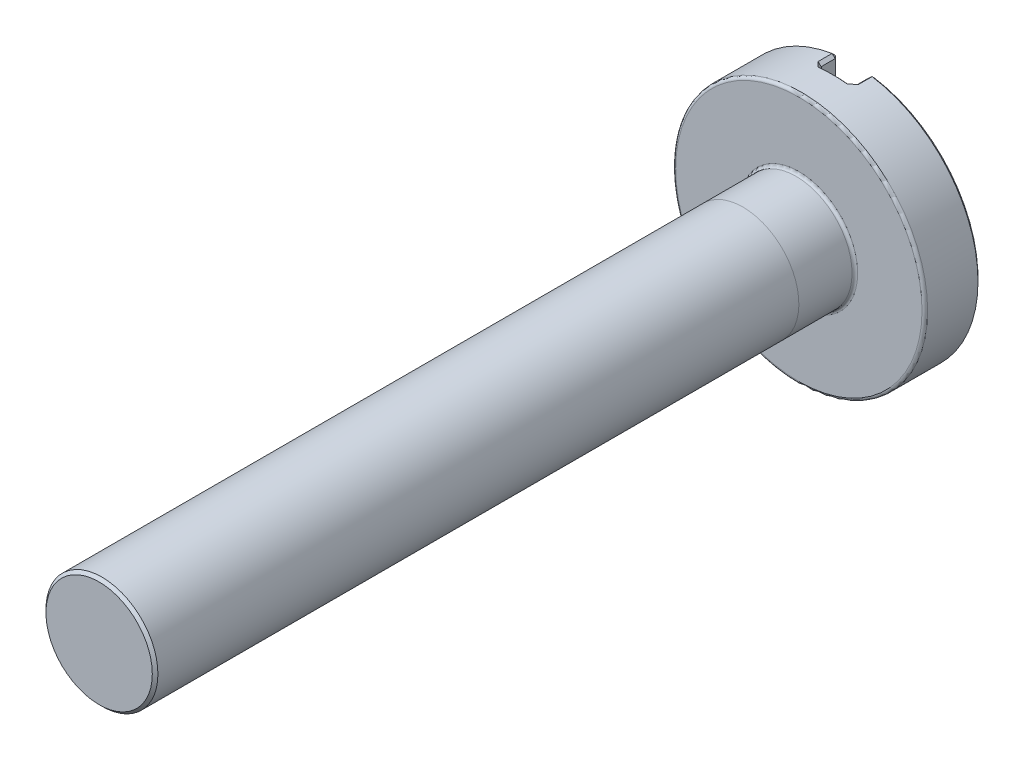
ISO-10303-21;
HEADER;
FILE_DESCRIPTION(('STEP AP214'),'2;1');
FILE_NAME('part.step','',(''),(''),'','','');
FILE_SCHEMA(('AUTOMOTIVE_DESIGN { 1 0 10303 214 1 1 1 1 }'));
ENDSEC;
DATA;
#1=APPLICATION_CONTEXT('core data for automotive mechanical design processes');
#2=APPLICATION_PROTOCOL_DEFINITION('international standard','automotive_design',2000,#1);
#3=PRODUCT_CONTEXT('',#1,'mechanical');
#4=PRODUCT('Part','Part','',(#3));
#5=PRODUCT_RELATED_PRODUCT_CATEGORY('part','',(#4));
#6=PRODUCT_DEFINITION_FORMATION('','',#4);
#7=PRODUCT_DEFINITION_CONTEXT('part definition',#1,'design');
#8=PRODUCT_DEFINITION('design','',#6,#7);
#9=PRODUCT_DEFINITION_SHAPE('','',#8);
#10=(LENGTH_UNIT() NAMED_UNIT(*) SI_UNIT(.MILLI.,.METRE.));
#11=(NAMED_UNIT(*) PLANE_ANGLE_UNIT() SI_UNIT($,.RADIAN.));
#12=(NAMED_UNIT(*) SI_UNIT($,.STERADIAN.) SOLID_ANGLE_UNIT());
#13=UNCERTAINTY_MEASURE_WITH_UNIT(LENGTH_MEASURE(1.E-05),#10,'distance_accuracy_value','');
#14=(GEOMETRIC_REPRESENTATION_CONTEXT(3) GLOBAL_UNCERTAINTY_ASSIGNED_CONTEXT((#13)) GLOBAL_UNIT_ASSIGNED_CONTEXT((#10,
#11,#12)) REPRESENTATION_CONTEXT('',''));
#15=CARTESIAN_POINT('',(0.,0.,0.));
#16=DIRECTION('',(0.,0.,1.));
#17=DIRECTION('',(1.,0.,0.));
#18=AXIS2_PLACEMENT_3D('',#15,#16,#17);
#19=CARTESIAN_POINT('',(0.,0.,12.5));
#20=DIRECTION('',(0.,0.,-1.));
#21=DIRECTION('',(-1.,0.,0.));
#22=AXIS2_PLACEMENT_3D('',#19,#20,#21);
#23=CYLINDRICAL_SURFACE('',#22,1.);
#24=CARTESIAN_POINT('',(0.,0.,12.45));
#25=DIRECTION('',(0.,0.,1.));
#26=DIRECTION('',(1.,0.,0.));
#27=AXIS2_PLACEMENT_3D('',#24,#25,#26);
#28=CIRCLE('',#27,1.);
#29=CARTESIAN_POINT('',(1.,0.,12.45));
#30=VERTEX_POINT('',#29);
#31=EDGE_CURVE('E49',#30,#30,#28,.F.);
#32=ORIENTED_EDGE('',*,*,#31,.T.);
#33=EDGE_LOOP('',(#32));
#34=FACE_BOUND('',#33,.T.);
#35=CARTESIAN_POINT('',(0.,0.,1.));
#36=DIRECTION('',(0.,0.,-1.));
#37=DIRECTION('',(0.,1.,0.));
#38=AXIS2_PLACEMENT_3D('',#35,#36,#37);
#39=CIRCLE('',#38,1.);
#40=CARTESIAN_POINT('',(0.,1.,1.));
#41=VERTEX_POINT('',#40);
#42=EDGE_CURVE('E11',#41,#41,#39,.T.);
#43=ORIENTED_EDGE('',*,*,#42,.F.);
#44=EDGE_LOOP('',(#43));
#45=FACE_BOUND('',#44,.T.);
#46=ADVANCED_FACE('F39',(#34,#45),#23,.T.);
#47=CARTESIAN_POINT('',(0.,0.,-1.));
#48=DIRECTION('',(0.,0.,1.));
#49=DIRECTION('',(1.,0.,0.));
#50=AXIS2_PLACEMENT_3D('',#47,#48,#49);
#51=CYLINDRICAL_SURFACE('',#50,2.25);
#52=CARTESIAN_POINT('',(0.,0.,-0.05));
#53=DIRECTION('',(0.,0.,1.));
#54=DIRECTION('',(1.,0.,0.));
#55=AXIS2_PLACEMENT_3D('',#52,#53,#54);
#56=CIRCLE('',#55,2.25);
#57=CARTESIAN_POINT('',(2.25,0.,-0.05));
#58=VERTEX_POINT('',#57);
#59=EDGE_CURVE('E506',#58,#58,#56,.F.);
#60=ORIENTED_EDGE('',*,*,#59,.T.);
#61=EDGE_LOOP('',(#60));
#62=FACE_BOUND('',#61,.T.);
#63=CARTESIAN_POINT('',(0.357954545454545,-2.22134385978138,-0.7));
#64=CARTESIAN_POINT('',(0.349044313577281,-2.22277959220945,-0.691081725524456));
#65=CARTESIAN_POINT('',(0.340106008970925,-2.22416500607063,-0.682183310951015));
#66=CARTESIAN_POINT('',(0.322168315908917,-2.22683406364462,-0.66443290328283));
#67=CARTESIAN_POINT('',(0.313168927393422,-2.2281177072577,-0.655580910233578));
#68=CARTESIAN_POINT('',(0.288093679970526,-2.2315384498966,-0.631080236997653));
#69=CARTESIAN_POINT('',(0.271946710820839,-2.23356468320811,-0.615488807873462));
#70=CARTESIAN_POINT('',(0.255681818186013,-2.23542541988267,-0.600000000002841));
#71=B_SPLINE_CURVE_WITH_KNOTS('',3,(#63,#64,#65,#66,#67,#68,#69,#70),.UNSPECIFIED.,.F.,.F.,(4,2,
2,4),(0.,0.0380643972705644,0.0761288318363076,0.143736873551843),.UNSPECIFIED.);
#72=CARTESIAN_POINT('',(0.357954545454545,-2.22134385978138,-0.7));
#73=VERTEX_POINT('',#72);
#74=CARTESIAN_POINT('',(0.255681818181818,-2.23542541988124,-0.6));
#75=VERTEX_POINT('',#74);
#76=EDGE_CURVE('E251',#73,#75,#71,.T.);
#77=ORIENTED_EDGE('',*,*,#76,.F.);
#78=DIRECTION('',(0.,0.,1.));
#79=VECTOR('',#78,1.);
#80=CARTESIAN_POINT('',(0.357954545454545,-2.22134385978138,-1.));
#81=LINE('',#80,#79);
#82=CARTESIAN_POINT('',(0.357954545454545,-2.22134385978138,-0.95));
#83=VERTEX_POINT('',#82);
#84=EDGE_CURVE('E249',#73,#83,#81,.F.);
#85=ORIENTED_EDGE('',*,*,#84,.T.);
#86=CARTESIAN_POINT('',(0.,0.,-0.95));
#87=DIRECTION('',(0.,0.,1.));
#88=DIRECTION('',(1.,0.,0.));
#89=AXIS2_PLACEMENT_3D('',#86,#87,#88);
#90=CIRCLE('',#89,2.25);
#91=CARTESIAN_POINT('',(0.357954545454545,2.22134385978138,-0.95));
#92=VERTEX_POINT('',#91);
#93=EDGE_CURVE('E245',#83,#92,#90,.T.);
#94=ORIENTED_EDGE('',*,*,#93,.T.);
#95=DIRECTION('',(0.,0.,1.));
#96=VECTOR('',#95,1.);
#97=CARTESIAN_POINT('',(0.357954545454545,2.22134385978138,-1.));
#98=LINE('',#97,#96);
#99=CARTESIAN_POINT('',(0.357954545454545,2.22134385978138,-0.7));
#100=VERTEX_POINT('',#99);
#101=EDGE_CURVE('E236',#92,#100,#98,.T.);
#102=ORIENTED_EDGE('',*,*,#101,.T.);
#103=CARTESIAN_POINT('',(0.255681818181818,2.23542541988124,-0.6));
#104=CARTESIAN_POINT('',(0.264839427943543,2.23437790052862,-0.608719796943994));
#105=CARTESIAN_POINT('',(0.273959417330191,2.23327784719118,-0.617472569925155));
#106=CARTESIAN_POINT('',(0.29212937173172,2.23097387990717,-0.635036917762392));
#107=CARTESIAN_POINT('',(0.301179336862998,2.22976996613328,-0.643848492520682));
#108=CARTESIAN_POINT('',(0.326213414850236,2.22628523492306,-0.668382417252336));
#109=CARTESIAN_POINT('',(0.342127740146839,2.22389382114135,-0.68416044499739));
#110=CARTESIAN_POINT('',(0.357954545456661,2.22134385978236,-0.700000000001358));
#111=B_SPLINE_CURVE_WITH_KNOTS('',3,(#103,#104,#105,#106,#107,#108,#109,#110),.UNSPECIFIED.,.F.,
.F.,(4,2,2,4),(0.,0.0380645508803724,0.0761290384749272,0.143736997088426),.UNSPECIFIED.);
#112=CARTESIAN_POINT('',(0.255681818181818,2.23542541988124,-0.6));
#113=VERTEX_POINT('',#112);
#114=EDGE_CURVE('E229',#113,#100,#111,.T.);
#115=ORIENTED_EDGE('',*,*,#114,.F.);
#116=CARTESIAN_POINT('',(0.,0.,-0.6));
#117=DIRECTION('',(0.,0.,-1.));
#118=DIRECTION('',(-1.,0.,0.));
#119=AXIS2_PLACEMENT_3D('',#116,#117,#118);
#120=CIRCLE('',#119,2.25);
#121=CARTESIAN_POINT('',(-0.255681818181818,2.23542541988124,-0.6));
#122=VERTEX_POINT('',#121);
#123=EDGE_CURVE('E192',#113,#122,#120,.F.);
#124=ORIENTED_EDGE('',*,*,#123,.T.);
#125=CARTESIAN_POINT('',(-0.357954545454545,2.22134385978138,-0.7));
#126=CARTESIAN_POINT('',(-0.349044313577281,2.22277959220945,-0.691081725524456));
#127=CARTESIAN_POINT('',(-0.340106008970926,2.22416500607064,-0.682183310951015));
#128=CARTESIAN_POINT('',(-0.322168315908917,2.22683406364462,-0.66443290328283));
#129=CARTESIAN_POINT('',(-0.313168927393423,2.2281177072577,-0.655580910233578));
#130=CARTESIAN_POINT('',(-0.288093679970526,2.2315384498966,-0.631080236997653));
#131=CARTESIAN_POINT('',(-0.271946710820839,2.23356468320811,-0.615488807873462));
#132=CARTESIAN_POINT('',(-0.255681818186013,2.23542541988267,-0.600000000002841));
#133=B_SPLINE_CURVE_WITH_KNOTS('',3,(#125,#126,#127,#128,#129,#130,#131,#132),.UNSPECIFIED.,.F.,
.F.,(4,2,2,4),(0.,0.0380643972705644,0.0761288318363076,0.143736873551843),.UNSPECIFIED.);
#134=CARTESIAN_POINT('',(-0.357954545454545,2.22134385978138,-0.7));
#135=VERTEX_POINT('',#134);
#136=EDGE_CURVE('E183',#135,#122,#133,.T.);
#137=ORIENTED_EDGE('',*,*,#136,.F.);
#138=DIRECTION('',(0.,0.,1.));
#139=VECTOR('',#138,1.);
#140=CARTESIAN_POINT('',(-0.357954545454545,2.22134385978138,-1.));
#141=LINE('',#140,#139);
#142=CARTESIAN_POINT('',(-0.357954545454545,2.22134385978138,-0.95));
#143=VERTEX_POINT('',#142);
#144=EDGE_CURVE('E180',#135,#143,#141,.F.);
#145=ORIENTED_EDGE('',*,*,#144,.T.);
#146=CARTESIAN_POINT('',(0.,0.,-0.95));
#147=DIRECTION('',(0.,0.,1.));
#148=DIRECTION('',(1.,0.,0.));
#149=AXIS2_PLACEMENT_3D('',#146,#147,#148);
#150=CIRCLE('',#149,2.25);
#151=CARTESIAN_POINT('',(-0.357954545454545,-2.22134385978138,-0.95));
#152=VERTEX_POINT('',#151);
#153=EDGE_CURVE('E175',#143,#152,#150,.T.);
#154=ORIENTED_EDGE('',*,*,#153,.T.);
#155=DIRECTION('',(0.,0.,1.));
#156=VECTOR('',#155,1.);
#157=CARTESIAN_POINT('',(-0.357954545454545,-2.22134385978138,-1.));
#158=LINE('',#157,#156);
#159=CARTESIAN_POINT('',(-0.357954545454545,-2.22134385978138,-0.7));
#160=VERTEX_POINT('',#159);
#161=EDGE_CURVE('E150',#152,#160,#158,.T.);
#162=ORIENTED_EDGE('',*,*,#161,.T.);
#163=CARTESIAN_POINT('',(-0.255681818181818,-2.23542541988124,-0.6));
#164=CARTESIAN_POINT('',(-0.264839427943543,-2.23437790052862,-0.608719796943994));
#165=CARTESIAN_POINT('',(-0.273959417330191,-2.23327784719118,-0.617472569925155));
#166=CARTESIAN_POINT('',(-0.29212937173172,-2.23097387990717,-0.635036917762393));
#167=CARTESIAN_POINT('',(-0.301179336862998,-2.22976996613328,-0.643848492520682));
#168=CARTESIAN_POINT('',(-0.326213414850237,-2.22628523492307,-0.668382417252336));
#169=CARTESIAN_POINT('',(-0.342127740146839,-2.22389382114135,-0.684160444997389));
#170=CARTESIAN_POINT('',(-0.357954545456661,-2.22134385978236,-0.700000000001358));
#171=B_SPLINE_CURVE_WITH_KNOTS('',3,(#163,#164,#165,#166,#167,#168,#169,#170),.UNSPECIFIED.,.F.,
.F.,(4,2,2,4),(0.,0.0380645508803725,0.0761290384749272,0.143736997088426),.UNSPECIFIED.);
#172=CARTESIAN_POINT('',(-0.255681818181818,-2.23542541988124,-0.6));
#173=VERTEX_POINT('',#172);
#174=EDGE_CURVE('E238',#173,#160,#171,.T.);
#175=ORIENTED_EDGE('',*,*,#174,.F.);
#176=CARTESIAN_POINT('',(0.,0.,-0.6));
#177=DIRECTION('',(0.,0.,-1.));
#178=DIRECTION('',(-1.,0.,0.));
#179=AXIS2_PLACEMENT_3D('',#176,#177,#178);
#180=CIRCLE('',#179,2.25);
#181=EDGE_CURVE('E247',#173,#75,#180,.F.);
#182=ORIENTED_EDGE('',*,*,#181,.T.);
#183=EDGE_LOOP('',(#77,#85,#94,#102,#115,#124,#137,#145,#154,#162,#175,#182));
#184=FACE_BOUND('',#183,.T.);
#185=ADVANCED_FACE('F194',(#62,#184),#51,.T.);
#186=CARTESIAN_POINT('',(0.,0.,-1.));
#187=DIRECTION('',(0.,0.,1.));
#188=DIRECTION('',(1.,0.,0.));
#189=AXIS2_PLACEMENT_3D('',#186,#187,#188);
#190=PLANE('',#189);
#191=CARTESIAN_POINT('',(0.,0.,-1.));
#192=DIRECTION('',(0.,0.,1.));
#193=DIRECTION('',(1.,0.,0.));
#194=AXIS2_PLACEMENT_3D('',#191,#192,#193);
#195=CIRCLE('',#194,2.2);
#196=CARTESIAN_POINT('',(0.35,2.17198066289735,-1.));
#197=VERTEX_POINT('',#196);
#198=CARTESIAN_POINT('',(0.35,-2.17198066289735,-1.));
#199=VERTEX_POINT('',#198);
#200=EDGE_CURVE('E551',#197,#199,#195,.F.);
#201=ORIENTED_EDGE('',*,*,#200,.T.);
#202=DIRECTION('',(0.,1.,0.));
#203=VECTOR('',#202,1.);
#204=CARTESIAN_POINT('',(0.35,0.,-1.));
#205=LINE('',#204,#203);
#206=EDGE_CURVE('E595',#199,#197,#205,.T.);
#207=ORIENTED_EDGE('',*,*,#206,.T.);
#208=EDGE_LOOP('',(#201,#207));
#209=FACE_BOUND('',#208,.T.);
#210=ADVANCED_FACE('F485',(#209),#190,.F.);
#211=ORIENTED_EDGE('',*,*,#42,.T.);
#212=EDGE_LOOP('',(#211));
#213=FACE_BOUND('',#212,.T.);
#214=CARTESIAN_POINT('',(0.,0.,0.0499999999999997));
#215=DIRECTION('',(0.,0.,1.));
#216=DIRECTION('',(1.,0.,0.));
#217=AXIS2_PLACEMENT_3D('',#214,#215,#216);
#218=CIRCLE('',#217,1.);
#219=CARTESIAN_POINT('',(1.,0.,0.0499999999999997));
#220=VERTEX_POINT('',#219);
#221=EDGE_CURVE('E504',#220,#220,#218,.T.);
#222=ORIENTED_EDGE('',*,*,#221,.T.);
#223=EDGE_LOOP('',(#222));
#224=FACE_BOUND('',#223,.T.);
#225=ADVANCED_FACE('F207',(#213,#224),#23,.T.);
#226=CARTESIAN_POINT('',(0.,0.,12.5));
#227=DIRECTION('',(0.,0.,1.));
#228=DIRECTION('',(1.,0.,0.));
#229=AXIS2_PLACEMENT_3D('',#226,#227,#228);
#230=PLANE('',#229);
#231=CARTESIAN_POINT('',(0.,0.,12.5));
#232=DIRECTION('',(0.,0.,1.));
#233=DIRECTION('',(1.,0.,0.));
#234=AXIS2_PLACEMENT_3D('',#231,#232,#233);
#235=CIRCLE('',#234,0.950000000000003);
#236=CARTESIAN_POINT('',(0.950000000000003,0.,12.5));
#237=VERTEX_POINT('',#236);
#238=EDGE_CURVE('E505',#237,#237,#235,.T.);
#239=ORIENTED_EDGE('',*,*,#238,.T.);
#240=EDGE_LOOP('',(#239));
#241=FACE_BOUND('',#240,.T.);
#242=ADVANCED_FACE('F490',(#241),#230,.T.);
#243=CARTESIAN_POINT('',(0.,0.,-1.));
#244=DIRECTION('',(0.,0.,1.));
#245=DIRECTION('',(1.,0.,0.));
#246=AXIS2_PLACEMENT_3D('',#243,#244,#245);
#247=CIRCLE('',#246,2.2);
#248=CARTESIAN_POINT('',(-0.35,-2.17198066289735,-1.));
#249=VERTEX_POINT('',#248);
#250=CARTESIAN_POINT('',(-0.35,2.17198066289735,-1.));
#251=VERTEX_POINT('',#250);
#252=EDGE_CURVE('E55',#249,#251,#247,.F.);
#253=ORIENTED_EDGE('',*,*,#252,.T.);
#254=DIRECTION('',(0.,-1.,0.));
#255=VECTOR('',#254,1.);
#256=CARTESIAN_POINT('',(-0.35,0.,-1.));
#257=LINE('',#256,#255);
#258=EDGE_CURVE('E522',#251,#249,#257,.T.);
#259=ORIENTED_EDGE('',*,*,#258,.T.);
#260=EDGE_LOOP('',(#253,#259));
#261=FACE_BOUND('',#260,.T.);
#262=ADVANCED_FACE('F496',(#261),#190,.F.);
#263=CARTESIAN_POINT('',(0.,0.,0.));
#264=DIRECTION('',(0.,0.,1.));
#265=DIRECTION('',(1.,0.,0.));
#266=AXIS2_PLACEMENT_3D('',#263,#264,#265);
#267=PLANE('',#266);
#268=CARTESIAN_POINT('',(0.,0.,0.));
#269=DIRECTION('',(0.,0.,1.));
#270=DIRECTION('',(1.,0.,0.));
#271=AXIS2_PLACEMENT_3D('',#268,#269,#270);
#272=CIRCLE('',#271,2.2);
#273=CARTESIAN_POINT('',(2.2,0.,0.));
#274=VERTEX_POINT('',#273);
#275=EDGE_CURVE('E511',#274,#274,#272,.T.);
#276=ORIENTED_EDGE('',*,*,#275,.T.);
#277=EDGE_LOOP('',(#276));
#278=FACE_BOUND('',#277,.T.);
#279=CARTESIAN_POINT('',(0.,0.,0.));
#280=DIRECTION('',(0.,0.,1.));
#281=DIRECTION('',(1.,0.,0.));
#282=AXIS2_PLACEMENT_3D('',#279,#280,#281);
#283=CIRCLE('',#282,1.05);
#284=CARTESIAN_POINT('',(1.05,0.,0.));
#285=VERTEX_POINT('',#284);
#286=EDGE_CURVE('E519',#285,#285,#283,.F.);
#287=ORIENTED_EDGE('',*,*,#286,.T.);
#288=EDGE_LOOP('',(#287));
#289=FACE_BOUND('',#288,.T.);
#290=ADVANCED_FACE('F610',(#278,#289),#267,.T.);
#291=CARTESIAN_POINT('',(0.3,-5.11751622539691,-0.65));
#292=DIRECTION('',(1.,0.,0.));
#293=DIRECTION('',(0.,0.,-1.));
#294=AXIS2_PLACEMENT_3D('',#291,#292,#293);
#295=PLANE('',#294);
#296=DIRECTION('',(0.,0.,1.));
#297=VECTOR('',#296,1.);
#298=CARTESIAN_POINT('',(0.3,-2.17198066289735,-0.65));
#299=LINE('',#298,#297);
#300=CARTESIAN_POINT('',(0.3,-2.17198066289735,-0.95));
#301=VERTEX_POINT('',#300);
#302=CARTESIAN_POINT('',(0.3,-2.17198066289735,-0.7));
#303=VERTEX_POINT('',#302);
#304=EDGE_CURVE('E547',#301,#303,#299,.T.);
#305=ORIENTED_EDGE('',*,*,#304,.T.);
#306=DIRECTION('',(0.,1.,0.));
#307=VECTOR('',#306,1.);
#308=CARTESIAN_POINT('',(0.3,-5.11751622539691,-0.7));
#309=LINE('',#308,#307);
#310=CARTESIAN_POINT('',(0.3,2.17198066289735,-0.7));
#311=VERTEX_POINT('',#310);
#312=EDGE_CURVE('E865',#303,#311,#309,.T.);
#313=ORIENTED_EDGE('',*,*,#312,.T.);
#314=DIRECTION('',(0.,0.,-1.));
#315=VECTOR('',#314,1.);
#316=CARTESIAN_POINT('',(0.3,2.17198066289735,-1.));
#317=LINE('',#316,#315);
#318=CARTESIAN_POINT('',(0.3,2.17198066289735,-0.95));
#319=VERTEX_POINT('',#318);
#320=EDGE_CURVE('E868',#311,#319,#317,.T.);
#321=ORIENTED_EDGE('',*,*,#320,.T.);
#322=DIRECTION('',(0.,-1.,0.));
#323=VECTOR('',#322,1.);
#324=CARTESIAN_POINT('',(0.3,-5.11751622539691,-0.95));
#325=LINE('',#324,#323);
#326=EDGE_CURVE('E258',#319,#301,#325,.T.);
#327=ORIENTED_EDGE('',*,*,#326,.T.);
#328=EDGE_LOOP('',(#305,#313,#321,#327));
#329=FACE_BOUND('',#328,.T.);
#330=ADVANCED_FACE('F614',(#329),#295,.F.);
#331=CARTESIAN_POINT('',(-0.3,-5.11751622539691,-0.65));
#332=DIRECTION('',(-1.,0.,0.));
#333=DIRECTION('',(0.,0.,1.));
#334=AXIS2_PLACEMENT_3D('',#331,#332,#333);
#335=PLANE('',#334);
#336=DIRECTION('',(0.,0.,1.));
#337=VECTOR('',#336,1.);
#338=CARTESIAN_POINT('',(-0.3,2.17198066289735,-0.65));
#339=LINE('',#338,#337);
#340=CARTESIAN_POINT('',(-0.3,2.17198066289735,-0.95));
#341=VERTEX_POINT('',#340);
#342=CARTESIAN_POINT('',(-0.3,2.17198066289735,-0.7));
#343=VERTEX_POINT('',#342);
#344=EDGE_CURVE('E167',#341,#343,#339,.T.);
#345=ORIENTED_EDGE('',*,*,#344,.T.);
#346=DIRECTION('',(0.,-1.,0.));
#347=VECTOR('',#346,1.);
#348=CARTESIAN_POINT('',(-0.3,-5.11751622539691,-0.7));
#349=LINE('',#348,#347);
#350=CARTESIAN_POINT('',(-0.3,-2.17198066289735,-0.7));
#351=VERTEX_POINT('',#350);
#352=EDGE_CURVE('E172',#343,#351,#349,.T.);
#353=ORIENTED_EDGE('',*,*,#352,.T.);
#354=DIRECTION('',(0.,0.,-1.));
#355=VECTOR('',#354,1.);
#356=CARTESIAN_POINT('',(-0.3,-2.17198066289735,-1.));
#357=LINE('',#356,#355);
#358=CARTESIAN_POINT('',(-0.3,-2.17198066289735,-0.95));
#359=VERTEX_POINT('',#358);
#360=EDGE_CURVE('E148',#351,#359,#357,.T.);
#361=ORIENTED_EDGE('',*,*,#360,.T.);
#362=DIRECTION('',(0.,1.,0.));
#363=VECTOR('',#362,1.);
#364=CARTESIAN_POINT('',(-0.3,-5.11751622539691,-0.95));
#365=LINE('',#364,#363);
#366=EDGE_CURVE('E161',#359,#341,#365,.T.);
#367=ORIENTED_EDGE('',*,*,#366,.T.);
#368=EDGE_LOOP('',(#345,#353,#361,#367));
#369=FACE_BOUND('',#368,.T.);
#370=ADVANCED_FACE('F170',(#369),#335,.F.);
#371=CARTESIAN_POINT('',(0.,0.,-0.65));
#372=DIRECTION('',(0.,0.,-1.));
#373=DIRECTION('',(-1.,0.,0.));
#374=AXIS2_PLACEMENT_3D('',#371,#372,#373);
#375=PLANE('',#374);
#376=DIRECTION('',(0.,-1.,0.));
#377=VECTOR('',#376,1.);
#378=CARTESIAN_POINT('',(0.25,0.,-0.65));
#379=LINE('',#378,#377);
#380=CARTESIAN_POINT('',(0.25,2.18574929943944,-0.65));
#381=VERTEX_POINT('',#380);
#382=CARTESIAN_POINT('',(0.25,-2.18574929943944,-0.65));
#383=VERTEX_POINT('',#382);
#384=EDGE_CURVE('E586',#381,#383,#379,.T.);
#385=ORIENTED_EDGE('',*,*,#384,.T.);
#386=CARTESIAN_POINT('',(0.,0.,-0.65));
#387=DIRECTION('',(0.,0.,-1.));
#388=DIRECTION('',(-1.,0.,0.));
#389=AXIS2_PLACEMENT_3D('',#386,#387,#388);
#390=CIRCLE('',#389,2.2);
#391=CARTESIAN_POINT('',(-0.25,-2.18574929943944,-0.65));
#392=VERTEX_POINT('',#391);
#393=EDGE_CURVE('E565',#383,#392,#390,.T.);
#394=ORIENTED_EDGE('',*,*,#393,.T.);
#395=DIRECTION('',(0.,1.,0.));
#396=VECTOR('',#395,1.);
#397=CARTESIAN_POINT('',(-0.25,0.,-0.65));
#398=LINE('',#397,#396);
#399=CARTESIAN_POINT('',(-0.25,2.18574929943944,-0.65));
#400=VERTEX_POINT('',#399);
#401=EDGE_CURVE('E590',#392,#400,#398,.T.);
#402=ORIENTED_EDGE('',*,*,#401,.T.);
#403=CARTESIAN_POINT('',(0.,0.,-0.65));
#404=DIRECTION('',(0.,0.,-1.));
#405=DIRECTION('',(-1.,0.,0.));
#406=AXIS2_PLACEMENT_3D('',#403,#404,#405);
#407=CIRCLE('',#406,2.2);
#408=EDGE_CURVE('E583',#400,#381,#407,.T.);
#409=ORIENTED_EDGE('',*,*,#408,.T.);
#410=EDGE_LOOP('',(#385,#394,#402,#409));
#411=FACE_BOUND('',#410,.T.);
#412=ADVANCED_FACE('F467',(#411),#375,.T.);
#413=CARTESIAN_POINT('',(0.3,2.17198066289735,-0.95));
#414=DIRECTION('',(-0.544058820349419,0.638748776906851,-0.544058820349419));
#415=DIRECTION('',(0.,0.648424664440325,0.761278828383827));
#416=AXIS2_PLACEMENT_3D('',#413,#414,#415);
#417=PLANE('',#416);
#418=DIRECTION('',(0.761278828383827,0.648424664440324,0.));
#419=VECTOR('',#418,1.);
#420=CARTESIAN_POINT('',(0.3,2.17198066289735,-0.95));
#421=LINE('',#420,#419);
#422=EDGE_CURVE('E528',#92,#319,#421,.F.);
#423=ORIENTED_EDGE('',*,*,#422,.F.);
#424=DIRECTION('',(-0.112494260643311,-0.698101025154894,-0.707106781186548));
#425=VECTOR('',#424,1.);
#426=CARTESIAN_POINT('',(0.,0.,-3.2));
#427=LINE('',#426,#425);
#428=EDGE_CURVE('E168',#197,#92,#427,.F.);
#429=ORIENTED_EDGE('',*,*,#428,.F.);
#430=DIRECTION('',(0.707106781186547,0.,-0.707106781186547));
#431=VECTOR('',#430,1.);
#432=CARTESIAN_POINT('',(0.3,2.17198066289735,-0.95));
#433=LINE('',#432,#431);
#434=EDGE_CURVE('E525',#319,#197,#433,.T.);
#435=ORIENTED_EDGE('',*,*,#434,.F.);
#436=EDGE_LOOP('',(#423,#429,#435));
#437=FACE_BOUND('',#436,.T.);
#438=ADVANCED_FACE('F461',(#437),#417,.T.);
#439=CARTESIAN_POINT('',(0.,0.,-0.95));
#440=DIRECTION('',(0.,0.,1.));
#441=DIRECTION('',(1.,0.,0.));
#442=AXIS2_PLACEMENT_3D('',#439,#440,#441);
#443=CONICAL_SURFACE('',#442,2.25,0.785398163397448);
#444=ORIENTED_EDGE('',*,*,#428,.T.);
#445=ORIENTED_EDGE('',*,*,#93,.F.);
#446=DIRECTION('',(0.112494260643311,-0.698101025154894,0.707106781186548));
#447=VECTOR('',#446,1.);
#448=CARTESIAN_POINT('',(0.,0.,-3.2));
#449=LINE('',#448,#447);
#450=EDGE_CURVE('E531',#199,#83,#449,.T.);
#451=ORIENTED_EDGE('',*,*,#450,.F.);
#452=ORIENTED_EDGE('',*,*,#200,.F.);
#453=EDGE_LOOP('',(#444,#445,#451,#452));
#454=FACE_BOUND('',#453,.T.);
#455=ADVANCED_FACE('F455',(#454),#443,.T.);
#456=CARTESIAN_POINT('',(0.35,0.,-1.));
#457=DIRECTION('',(0.707106781186548,0.,0.707106781186548));
#458=DIRECTION('',(0.,1.,0.));
#459=AXIS2_PLACEMENT_3D('',#456,#457,#458);
#460=PLANE('',#459);
#461=ORIENTED_EDGE('',*,*,#434,.T.);
#462=ORIENTED_EDGE('',*,*,#206,.F.);
#463=DIRECTION('',(-0.707106781186547,0.,0.707106781186547));
#464=VECTOR('',#463,1.);
#465=CARTESIAN_POINT('',(0.328977272727272,-2.17198066289735,-0.978977272727273));
#466=LINE('',#465,#464);
#467=EDGE_CURVE('E534',#301,#199,#466,.F.);
#468=ORIENTED_EDGE('',*,*,#467,.F.);
#469=ORIENTED_EDGE('',*,*,#326,.F.);
#470=EDGE_LOOP('',(#461,#462,#468,#469));
#471=FACE_BOUND('',#470,.T.);
#472=ADVANCED_FACE('F448',(#471),#460,.F.);
#473=CARTESIAN_POINT('',(0.3,2.17198066289735,-1.));
#474=DIRECTION('',(-0.648424664440325,0.761278828383827,0.));
#475=DIRECTION('',(0.,0.,1.));
#476=AXIS2_PLACEMENT_3D('',#473,#474,#475);
#477=PLANE('',#476);
#478=ORIENTED_EDGE('',*,*,#422,.T.);
#479=ORIENTED_EDGE('',*,*,#320,.F.);
#480=DIRECTION('',(-0.761278828383827,-0.648424664440325,0.));
#481=VECTOR('',#480,1.);
#482=CARTESIAN_POINT('',(0.357954545454545,2.22134385978138,-0.7));
#483=LINE('',#482,#481);
#484=EDGE_CURVE('E536',#100,#311,#483,.T.);
#485=ORIENTED_EDGE('',*,*,#484,.F.);
#486=ORIENTED_EDGE('',*,*,#101,.F.);
#487=EDGE_LOOP('',(#478,#479,#485,#486));
#488=FACE_BOUND('',#487,.T.);
#489=ADVANCED_FACE('F441',(#488),#477,.T.);
#490=CARTESIAN_POINT('',(0.357954545454545,-2.22134385978138,-0.95));
#491=DIRECTION('',(-0.544058820349419,-0.638748776906851,-0.544058820349419));
#492=DIRECTION('',(0.,0.648424664440325,-0.761278828383827));
#493=AXIS2_PLACEMENT_3D('',#490,#491,#492);
#494=PLANE('',#493);
#495=ORIENTED_EDGE('',*,*,#467,.T.);
#496=ORIENTED_EDGE('',*,*,#450,.T.);
#497=DIRECTION('',(0.761278828383827,-0.648424664440324,0.));
#498=VECTOR('',#497,1.);
#499=CARTESIAN_POINT('',(0.357954545454545,-2.22134385978138,-0.95));
#500=LINE('',#499,#498);
#501=EDGE_CURVE('E396',#301,#83,#500,.T.);
#502=ORIENTED_EDGE('',*,*,#501,.F.);
#503=EDGE_LOOP('',(#495,#496,#502));
#504=FACE_BOUND('',#503,.T.);
#505=ADVANCED_FACE('F429',(#504),#494,.T.);
#506=CARTESIAN_POINT('',(0.25,2.18574929943944,-0.65));
#507=CARTESIAN_POINT('',(0.3,2.17198066289735,-0.7));
#508=CARTESIAN_POINT('',(0.255681818181818,2.23542541988124,-0.6));
#509=CARTESIAN_POINT('',(0.357954545454545,2.22134385978138,-0.7));
#510=CARTESIAN_POINT('',(0.255780939635302,2.23629203847129,-0.599127731209342));
#511=CARTESIAN_POINT('',(0.35896558428008,2.22220501930236,-0.7));
#512=B_SPLINE_SURFACE_WITH_KNOTS('',1,1,((#506,#507),(#508,#509),(#510,#511)),.UNSPECIFIED.,.F.,
.F.,.F.,(2,1,2),(2,2),(0.,1.,1.01744537581316),(0.,1.),.UNSPECIFIED.);
#513=CARTESIAN_POINT('',(0.3,2.17198066289735,-0.7));
#514=CARTESIAN_POINT('',(0.295596818382361,2.17319317904379,-0.695596818382361));
#515=CARTESIAN_POINT('',(0.291193636764722,2.17440569519023,-0.691193636764721));
#516=CARTESIAN_POINT('',(0.282387273529444,2.17683072748312,-0.682387273529443));
#517=CARTESIAN_POINT('',(0.277984091911805,2.17804324362956,-0.677984091911804));
#518=CARTESIAN_POINT('',(0.265720606862777,2.18142027299715,-0.665720606862777));
#519=CARTESIAN_POINT('',(0.257860303431389,2.18358478621829,-0.657860303431388));
#520=CARTESIAN_POINT('',(0.25,2.18574929943944,-0.65));
#521=B_SPLINE_CURVE_WITH_KNOTS('',3,(#513,#514,#515,#516,#517,#518,#519,#520),.UNSPECIFIED.,.F.,
.F.,(4,2,2,4),(0.,0.0190319707095956,0.0380639414191913,0.0720387073192474),.UNSPECIFIED.);
#522=EDGE_CURVE('E387',#381,#311,#521,.F.);
#523=DIRECTION('',(0.0803530433166526,0.702526432548803,0.70710678118655));
#524=VECTOR('',#523,1.);
#525=CARTESIAN_POINT('',(0.25,2.18574929943944,-0.65));
#526=LINE('',#525,#524);
#527=EDGE_CURVE('E397',#113,#381,#526,.F.);
#528=ORIENTED_EDGE('',*,*,#114,.T.);
#529=ORIENTED_EDGE('',*,*,#484,.T.);
#530=ORIENTED_EDGE('',*,*,#522,.F.);
#531=ORIENTED_EDGE('',*,*,#527,.F.);
#532=EDGE_LOOP('',(#528,#529,#530,#531));
#533=FACE_BOUND('',#532,.T.);
#534=ADVANCED_FACE('F420',(#533),#512,.T.);
#535=CARTESIAN_POINT('',(0.3,-2.17198066289735,-1.));
#536=DIRECTION('',(0.648424664440325,0.761278828383827,0.));
#537=DIRECTION('',(0.,0.,1.));
#538=AXIS2_PLACEMENT_3D('',#535,#536,#537);
#539=PLANE('',#538);
#540=ORIENTED_EDGE('',*,*,#501,.T.);
#541=ORIENTED_EDGE('',*,*,#84,.F.);
#542=DIRECTION('',(0.761278828383827,-0.648424664440325,0.));
#543=VECTOR('',#542,1.);
#544=CARTESIAN_POINT('',(0.3,-2.17198066289735,-0.7));
#545=LINE('',#544,#543);
#546=EDGE_CURVE('E561',#303,#73,#545,.T.);
#547=ORIENTED_EDGE('',*,*,#546,.F.);
#548=ORIENTED_EDGE('',*,*,#304,.F.);
#549=EDGE_LOOP('',(#540,#541,#547,#548));
#550=FACE_BOUND('',#549,.T.);
#551=ADVANCED_FACE('F371',(#550),#539,.F.);
#552=CARTESIAN_POINT('',(0.25,0.,-0.65));
#553=DIRECTION('',(0.707106781186548,0.,0.707106781186548));
#554=DIRECTION('',(0.,-1.,0.));
#555=AXIS2_PLACEMENT_3D('',#552,#553,#554);
#556=PLANE('',#555);
#557=ORIENTED_EDGE('',*,*,#522,.T.);
#558=ORIENTED_EDGE('',*,*,#312,.F.);
#559=CARTESIAN_POINT('',(0.25,-2.18574929943944,-0.65));
#560=CARTESIAN_POINT('',(0.254403181617639,-2.184536783293,-0.654403181617639));
#561=CARTESIAN_POINT('',(0.258806363235278,-2.18332426714656,-0.658806363235278));
#562=CARTESIAN_POINT('',(0.267612726470557,-2.18089923485367,-0.667612726470556));
#563=CARTESIAN_POINT('',(0.272015908088196,-2.17968671870723,-0.672015908088195));
#564=CARTESIAN_POINT('',(0.284279393137223,-2.17630968933964,-0.684279393137223));
#565=CARTESIAN_POINT('',(0.292139696568611,-2.1741451761185,-0.692139696568611));
#566=CARTESIAN_POINT('',(0.3,-2.17198066289735,-0.7));
#567=B_SPLINE_CURVE_WITH_KNOTS('',3,(#559,#560,#561,#562,#563,#564,#565,#566),.UNSPECIFIED.,.F.,
.F.,(4,2,2,4),(0.,0.0190319707095956,0.0380639414191912,0.0720387073192474),.UNSPECIFIED.);
#568=EDGE_CURVE('E379',#383,#303,#567,.T.);
#569=ORIENTED_EDGE('',*,*,#568,.F.);
#570=ORIENTED_EDGE('',*,*,#384,.F.);
#571=EDGE_LOOP('',(#557,#558,#569,#570));
#572=FACE_BOUND('',#571,.T.);
#573=ADVANCED_FACE('F358',(#572),#556,.F.);
#574=CARTESIAN_POINT('',(0.,0.,-0.6));
#575=DIRECTION('',(0.,0.,1.));
#576=DIRECTION('',(1.,0.,0.));
#577=AXIS2_PLACEMENT_3D('',#574,#575,#576);
#578=CONICAL_SURFACE('',#577,2.25,0.785398163397448);
#579=ORIENTED_EDGE('',*,*,#527,.T.);
#580=ORIENTED_EDGE('',*,*,#408,.F.);
#581=DIRECTION('',(0.0803530433166526,-0.702526432548803,-0.70710678118655));
#582=VECTOR('',#581,1.);
#583=CARTESIAN_POINT('',(-0.255681818181818,2.23542541988124,-0.6));
#584=LINE('',#583,#582);
#585=EDGE_CURVE('E572',#122,#400,#584,.T.);
#586=ORIENTED_EDGE('',*,*,#585,.F.);
#587=ORIENTED_EDGE('',*,*,#123,.F.);
#588=EDGE_LOOP('',(#579,#580,#586,#587));
#589=FACE_BOUND('',#588,.T.);
#590=ADVANCED_FACE('F370',(#589),#578,.T.);
#591=CARTESIAN_POINT('',(-0.3,2.17198066289735,-1.));
#592=DIRECTION('',(-0.648424664440325,-0.761278828383827,0.));
#593=DIRECTION('',(0.,0.,1.));
#594=AXIS2_PLACEMENT_3D('',#591,#592,#593);
#595=PLANE('',#594);
#596=DIRECTION('',(-0.761278828383827,0.648424664440324,0.));
#597=VECTOR('',#596,1.);
#598=CARTESIAN_POINT('',(-0.357954545454545,2.22134385978138,-0.95));
#599=LINE('',#598,#597);
#600=EDGE_CURVE('E566',#143,#341,#599,.F.);
#601=ORIENTED_EDGE('',*,*,#600,.F.);
#602=ORIENTED_EDGE('',*,*,#144,.F.);
#603=DIRECTION('',(-0.761278828383827,0.648424664440325,0.));
#604=VECTOR('',#603,1.);
#605=CARTESIAN_POINT('',(-0.3,2.17198066289735,-0.7));
#606=LINE('',#605,#604);
#607=EDGE_CURVE('E568',#343,#135,#606,.T.);
#608=ORIENTED_EDGE('',*,*,#607,.F.);
#609=ORIENTED_EDGE('',*,*,#344,.F.);
#610=EDGE_LOOP('',(#601,#602,#608,#609));
#611=FACE_BOUND('',#610,.T.);
#612=ADVANCED_FACE('F665',(#611),#595,.F.);
#613=CARTESIAN_POINT('',(0.3,-2.17198066289735,-0.7));
#614=CARTESIAN_POINT('',(0.25,-2.18574929943944,-0.65));
#615=CARTESIAN_POINT('',(0.357954545454545,-2.22134385978138,-0.7));
#616=CARTESIAN_POINT('',(0.255681818181818,-2.23542541988124,-0.6));
#617=CARTESIAN_POINT('',(0.358954514606664,-2.22219559062918,-0.7));
#618=CARTESIAN_POINT('',(0.255779854373203,-2.2362825500278,-0.599137281515819));
#619=B_SPLINE_SURFACE_WITH_KNOTS('',1,1,((#613,#614),(#615,#616),(#617,#618)),.UNSPECIFIED.,.F.,
.F.,.F.,(2,1,2),(2,2),(0.,1.,1.01725436968363),(0.,1.),.UNSPECIFIED.);
#620=DIRECTION('',(-0.0803530433166526,0.702526432548803,-0.70710678118655));
#621=VECTOR('',#620,1.);
#622=CARTESIAN_POINT('',(0.255681818181818,-2.23542541988124,-0.6));
#623=LINE('',#622,#621);
#624=EDGE_CURVE('E316',#383,#75,#623,.F.);
#625=ORIENTED_EDGE('',*,*,#546,.T.);
#626=ORIENTED_EDGE('',*,*,#76,.T.);
#627=ORIENTED_EDGE('',*,*,#624,.F.);
#628=ORIENTED_EDGE('',*,*,#568,.T.);
#629=EDGE_LOOP('',(#625,#626,#627,#628));
#630=FACE_BOUND('',#629,.T.);
#631=ADVANCED_FACE('F356',(#630),#619,.T.);
#632=CARTESIAN_POINT('',(-0.3,2.17198066289735,-0.7));
#633=CARTESIAN_POINT('',(-0.25,2.18574929943944,-0.65));
#634=CARTESIAN_POINT('',(-0.357954545454545,2.22134385978138,-0.7));
#635=CARTESIAN_POINT('',(-0.255681818181818,2.23542541988124,-0.6));
#636=CARTESIAN_POINT('',(-0.358954514606665,2.22219559062918,-0.7));
#637=CARTESIAN_POINT('',(-0.255779854373203,2.2362825500278,-0.599137281515819));
#638=B_SPLINE_SURFACE_WITH_KNOTS('',1,1,((#632,#633),(#634,#635),(#636,#637)),.UNSPECIFIED.,.F.,
.F.,.F.,(2,1,2),(2,2),(0.,1.,1.01725436968363),(0.,1.),.UNSPECIFIED.);
#639=CARTESIAN_POINT('',(-0.25,2.18574929943944,-0.65));
#640=CARTESIAN_POINT('',(-0.254403181617639,2.184536783293,-0.654403181617639));
#641=CARTESIAN_POINT('',(-0.258806363235279,2.18332426714656,-0.658806363235278));
#642=CARTESIAN_POINT('',(-0.267612726470557,2.18089923485367,-0.667612726470556));
#643=CARTESIAN_POINT('',(-0.272015908088196,2.17968671870723,-0.672015908088195));
#644=CARTESIAN_POINT('',(-0.284279393137223,2.17630968933964,-0.684279393137223));
#645=CARTESIAN_POINT('',(-0.292139696568612,2.1741451761185,-0.692139696568611));
#646=CARTESIAN_POINT('',(-0.3,2.17198066289735,-0.7));
#647=B_SPLINE_CURVE_WITH_KNOTS('',3,(#639,#640,#641,#642,#643,#644,#645,#646),.UNSPECIFIED.,.F.,
.F.,(4,2,2,4),(0.,0.0190319707095956,0.0380639414191912,0.0720387073192474),.UNSPECIFIED.);
#648=EDGE_CURVE('E307',#343,#400,#647,.F.);
#649=ORIENTED_EDGE('',*,*,#136,.T.);
#650=ORIENTED_EDGE('',*,*,#585,.T.);
#651=ORIENTED_EDGE('',*,*,#648,.F.);
#652=ORIENTED_EDGE('',*,*,#607,.T.);
#653=EDGE_LOOP('',(#649,#650,#651,#652));
#654=FACE_BOUND('',#653,.T.);
#655=ADVANCED_FACE('F347',(#654),#638,.T.);
#656=CARTESIAN_POINT('',(-0.357954545454545,2.22134385978138,-0.95));
#657=DIRECTION('',(0.544058820349419,0.638748776906851,-0.544058820349419));
#658=DIRECTION('',(0.,0.648424664440325,0.761278828383827));
#659=AXIS2_PLACEMENT_3D('',#656,#657,#658);
#660=PLANE('',#659);
#661=DIRECTION('',(-0.112494260643311,0.698101025154894,0.707106781186548));
#662=VECTOR('',#661,1.);
#663=CARTESIAN_POINT('',(0.,0.,-3.2));
#664=LINE('',#663,#662);
#665=EDGE_CURVE('E608',#143,#251,#664,.F.);
#666=ORIENTED_EDGE('',*,*,#665,.F.);
#667=ORIENTED_EDGE('',*,*,#600,.T.);
#668=DIRECTION('',(0.707106781186547,0.,0.707106781186547));
#669=VECTOR('',#668,1.);
#670=CARTESIAN_POINT('',(-0.328977272727273,2.17198066289735,-0.978977272727273));
#671=LINE('',#670,#669);
#672=EDGE_CURVE('E164',#251,#341,#671,.T.);
#673=ORIENTED_EDGE('',*,*,#672,.F.);
#674=EDGE_LOOP('',(#666,#667,#673));
#675=FACE_BOUND('',#674,.T.);
#676=ADVANCED_FACE('F340',(#675),#660,.T.);
#677=CARTESIAN_POINT('',(0.,0.,-0.6));
#678=DIRECTION('',(0.,0.,1.));
#679=DIRECTION('',(1.,0.,0.));
#680=AXIS2_PLACEMENT_3D('',#677,#678,#679);
#681=CONICAL_SURFACE('',#680,2.25,0.785398163397448);
#682=ORIENTED_EDGE('',*,*,#624,.T.);
#683=ORIENTED_EDGE('',*,*,#181,.F.);
#684=DIRECTION('',(-0.0803530433166526,-0.702526432548803,0.70710678118655));
#685=VECTOR('',#684,1.);
#686=CARTESIAN_POINT('',(-0.25,-2.18574929943944,-0.65));
#687=LINE('',#686,#685);
#688=EDGE_CURVE('E603',#392,#173,#687,.T.);
#689=ORIENTED_EDGE('',*,*,#688,.F.);
#690=ORIENTED_EDGE('',*,*,#393,.F.);
#691=EDGE_LOOP('',(#682,#683,#689,#690));
#692=FACE_BOUND('',#691,.T.);
#693=ADVANCED_FACE('F293',(#692),#681,.T.);
#694=CARTESIAN_POINT('',(-0.25,0.,-0.65));
#695=DIRECTION('',(-0.707106781186548,0.,0.707106781186548));
#696=DIRECTION('',(0.,1.,0.));
#697=AXIS2_PLACEMENT_3D('',#694,#695,#696);
#698=PLANE('',#697);
#699=ORIENTED_EDGE('',*,*,#648,.T.);
#700=ORIENTED_EDGE('',*,*,#401,.F.);
#701=CARTESIAN_POINT('',(-0.3,-2.17198066289735,-0.7));
#702=CARTESIAN_POINT('',(-0.295596818382361,-2.17319317904379,-0.695596818382361));
#703=CARTESIAN_POINT('',(-0.291193636764722,-2.17440569519023,-0.691193636764721));
#704=CARTESIAN_POINT('',(-0.282387273529444,-2.17683072748312,-0.682387273529443));
#705=CARTESIAN_POINT('',(-0.277984091911805,-2.17804324362956,-0.677984091911804));
#706=CARTESIAN_POINT('',(-0.265720606862777,-2.18142027299715,-0.665720606862777));
#707=CARTESIAN_POINT('',(-0.257860303431389,-2.18358478621829,-0.657860303431388));
#708=CARTESIAN_POINT('',(-0.25,-2.18574929943944,-0.65));
#709=B_SPLINE_CURVE_WITH_KNOTS('',3,(#701,#702,#703,#704,#705,#706,#707,#708),.UNSPECIFIED.,.F.,
.F.,(4,2,2,4),(0.,0.0190319707095956,0.0380639414191913,0.0720387073192474),.UNSPECIFIED.);
#710=EDGE_CURVE('E158',#351,#392,#709,.T.);
#711=ORIENTED_EDGE('',*,*,#710,.F.);
#712=ORIENTED_EDGE('',*,*,#352,.F.);
#713=EDGE_LOOP('',(#699,#700,#711,#712));
#714=FACE_BOUND('',#713,.T.);
#715=ADVANCED_FACE('F286',(#714),#698,.F.);
#716=CARTESIAN_POINT('',(-0.35,0.,-1.));
#717=DIRECTION('',(-0.707106781186548,0.,0.707106781186548));
#718=DIRECTION('',(0.,-1.,0.));
#719=AXIS2_PLACEMENT_3D('',#716,#717,#718);
#720=PLANE('',#719);
#721=ORIENTED_EDGE('',*,*,#672,.T.);
#722=ORIENTED_EDGE('',*,*,#366,.F.);
#723=DIRECTION('',(-0.707106781186547,0.,-0.707106781186547));
#724=VECTOR('',#723,1.);
#725=CARTESIAN_POINT('',(-0.3,-2.17198066289735,-0.95));
#726=LINE('',#725,#724);
#727=EDGE_CURVE('E153',#249,#359,#726,.F.);
#728=ORIENTED_EDGE('',*,*,#727,.F.);
#729=ORIENTED_EDGE('',*,*,#258,.F.);
#730=EDGE_LOOP('',(#721,#722,#728,#729));
#731=FACE_BOUND('',#730,.T.);
#732=ADVANCED_FACE('F162',(#731),#720,.F.);
#733=CARTESIAN_POINT('',(0.,0.,-0.95));
#734=DIRECTION('',(0.,0.,1.));
#735=DIRECTION('',(1.,0.,0.));
#736=AXIS2_PLACEMENT_3D('',#733,#734,#735);
#737=CONICAL_SURFACE('',#736,2.25,0.785398163397448);
#738=ORIENTED_EDGE('',*,*,#665,.T.);
#739=ORIENTED_EDGE('',*,*,#252,.F.);
#740=DIRECTION('',(0.112494260643311,0.698101025154894,-0.707106781186548));
#741=VECTOR('',#740,1.);
#742=CARTESIAN_POINT('',(0.,0.,-3.2));
#743=LINE('',#742,#741);
#744=EDGE_CURVE('E63',#152,#249,#743,.T.);
#745=ORIENTED_EDGE('',*,*,#744,.F.);
#746=ORIENTED_EDGE('',*,*,#153,.F.);
#747=EDGE_LOOP('',(#738,#739,#745,#746));
#748=FACE_BOUND('',#747,.T.);
#749=ADVANCED_FACE('F607',(#748),#737,.T.);
#750=CARTESIAN_POINT('',(-0.25,-2.18574929943944,-0.65));
#751=CARTESIAN_POINT('',(-0.3,-2.17198066289735,-0.7));
#752=CARTESIAN_POINT('',(-0.255681818181818,-2.23542541988124,-0.6));
#753=CARTESIAN_POINT('',(-0.357954545454545,-2.22134385978138,-0.7));
#754=CARTESIAN_POINT('',(-0.255780939635302,-2.23629203847129,-0.599127731209342));
#755=CARTESIAN_POINT('',(-0.35896558428008,-2.22220501930236,-0.7));
#756=B_SPLINE_SURFACE_WITH_KNOTS('',1,1,((#750,#751),(#752,#753),(#754,#755)),.UNSPECIFIED.,.F.,
.F.,.F.,(2,1,2),(2,2),(0.,1.,1.01744537581316),(0.,1.),.UNSPECIFIED.);
#757=DIRECTION('',(0.761278828383827,0.648424664440325,0.));
#758=VECTOR('',#757,1.);
#759=CARTESIAN_POINT('',(-0.357954545454545,-2.22134385978138,-0.7));
#760=LINE('',#759,#758);
#761=EDGE_CURVE('E151',#351,#160,#760,.F.);
#762=ORIENTED_EDGE('',*,*,#688,.T.);
#763=ORIENTED_EDGE('',*,*,#174,.T.);
#764=ORIENTED_EDGE('',*,*,#761,.F.);
#765=ORIENTED_EDGE('',*,*,#710,.T.);
#766=EDGE_LOOP('',(#762,#763,#764,#765));
#767=FACE_BOUND('',#766,.T.);
#768=ADVANCED_FACE('F285',(#767),#756,.T.);
#769=CARTESIAN_POINT('',(-0.3,-2.17198066289735,-0.95));
#770=DIRECTION('',(0.544058820349419,-0.638748776906851,-0.544058820349419));
#771=DIRECTION('',(0.,0.648424664440325,-0.761278828383827));
#772=AXIS2_PLACEMENT_3D('',#769,#770,#771);
#773=PLANE('',#772);
#774=ORIENTED_EDGE('',*,*,#744,.T.);
#775=ORIENTED_EDGE('',*,*,#727,.T.);
#776=DIRECTION('',(-0.761278828383827,-0.648424664440324,0.));
#777=VECTOR('',#776,1.);
#778=CARTESIAN_POINT('',(-0.3,-2.17198066289735,-0.95));
#779=LINE('',#778,#777);
#780=EDGE_CURVE('E145',#152,#359,#779,.F.);
#781=ORIENTED_EDGE('',*,*,#780,.F.);
#782=EDGE_LOOP('',(#774,#775,#781));
#783=FACE_BOUND('',#782,.T.);
#784=ADVANCED_FACE('F155',(#783),#773,.T.);
#785=CARTESIAN_POINT('',(-0.3,-2.17198066289735,-1.));
#786=DIRECTION('',(0.648424664440325,-0.761278828383827,0.));
#787=DIRECTION('',(0.,0.,1.));
#788=AXIS2_PLACEMENT_3D('',#785,#786,#787);
#789=PLANE('',#788);
#790=ORIENTED_EDGE('',*,*,#761,.T.);
#791=ORIENTED_EDGE('',*,*,#161,.F.);
#792=ORIENTED_EDGE('',*,*,#780,.T.);
#793=ORIENTED_EDGE('',*,*,#360,.F.);
#794=EDGE_LOOP('',(#790,#791,#792,#793));
#795=FACE_BOUND('',#794,.T.);
#796=ADVANCED_FACE('F146',(#795),#789,.T.);
#797=CARTESIAN_POINT('',(0.,0.,-0.05));
#798=DIRECTION('',(0.,0.,1.));
#799=DIRECTION('',(1.,0.,0.));
#800=AXIS2_PLACEMENT_3D('',#797,#798,#799);
#801=TOROIDAL_SURFACE('',#800,2.2,0.05);
#802=ORIENTED_EDGE('',*,*,#59,.F.);
#803=EDGE_LOOP('',(#802));
#804=FACE_BOUND('',#803,.T.);
#805=ORIENTED_EDGE('',*,*,#275,.F.);
#806=EDGE_LOOP('',(#805));
#807=FACE_BOUND('',#806,.T.);
#808=ADVANCED_FACE('F279',(#804,#807),#801,.T.);
#809=CARTESIAN_POINT('',(0.,0.,0.0499999999999997));
#810=DIRECTION('',(0.,0.,1.));
#811=DIRECTION('',(1.,0.,0.));
#812=AXIS2_PLACEMENT_3D('',#809,#810,#811);
#813=TOROIDAL_SURFACE('',#812,1.05,0.05);
#814=ORIENTED_EDGE('',*,*,#286,.F.);
#815=EDGE_LOOP('',(#814));
#816=FACE_BOUND('',#815,.T.);
#817=ORIENTED_EDGE('',*,*,#221,.F.);
#818=EDGE_LOOP('',(#817));
#819=FACE_BOUND('',#818,.T.);
#820=ADVANCED_FACE('F470',(#816,#819),#813,.F.);
#821=CARTESIAN_POINT('',(0.,0.,12.5));
#822=DIRECTION('',(0.,0.,-1.));
#823=DIRECTION('',(-1.,0.,0.));
#824=AXIS2_PLACEMENT_3D('',#821,#822,#823);
#825=CONICAL_SURFACE('',#824,0.950000000000003,0.78539816339744);
#826=ORIENTED_EDGE('',*,*,#31,.F.);
#827=EDGE_LOOP('',(#826));
#828=FACE_BOUND('',#827,.T.);
#829=ORIENTED_EDGE('',*,*,#238,.F.);
#830=EDGE_LOOP('',(#829));
#831=FACE_BOUND('',#830,.T.);
#832=ADVANCED_FACE('F42',(#828,#831),#825,.T.);
#833=CLOSED_SHELL('',(#46,#185,#210,#225,#242,#262,#290,#330,#370,#412,#438,#455,#472,#489,#505,
#534,#551,#573,#590,#612,#631,#655,#676,#693,#715,#732,#749,#768,#784,#796,#808,#820,#832));
#834=MANIFOLD_SOLID_BREP('B2',#833);
#835=ADVANCED_BREP_SHAPE_REPRESENTATION('',(#18,#834),#14);
#836=SHAPE_DEFINITION_REPRESENTATION(#9,#835);
ENDSEC;
END-ISO-10303-21;
